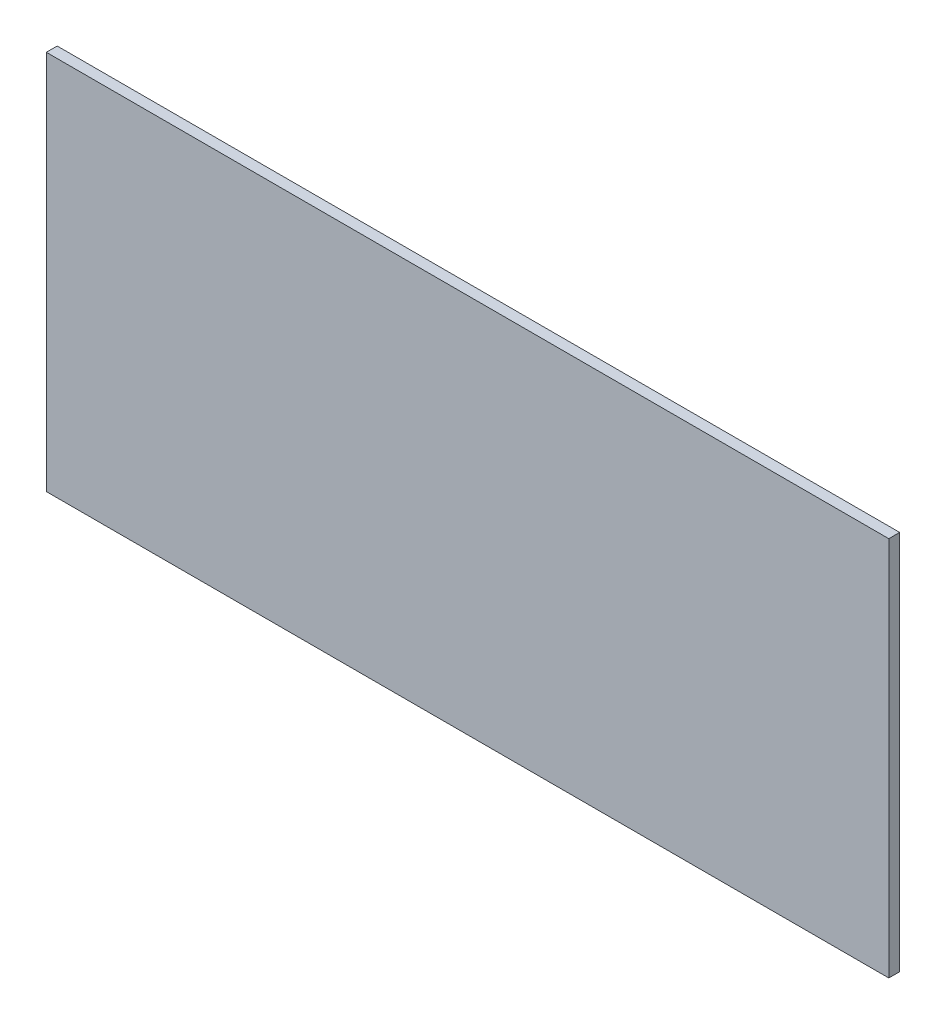
ISO-10303-21;
HEADER;
FILE_DESCRIPTION(('STEP AP214'),'2;1');
FILE_NAME('part.step','',(''),(''),'','','');
FILE_SCHEMA(('AUTOMOTIVE_DESIGN { 1 0 10303 214 1 1 1 1 }'));
ENDSEC;
DATA;
#1=APPLICATION_CONTEXT('core data for automotive mechanical design processes');
#2=APPLICATION_PROTOCOL_DEFINITION('international standard','automotive_design',2000,#1);
#3=PRODUCT_CONTEXT('',#1,'mechanical');
#4=PRODUCT('Part','Part','',(#3));
#5=PRODUCT_RELATED_PRODUCT_CATEGORY('part','',(#4));
#6=PRODUCT_DEFINITION_FORMATION('','',#4);
#7=PRODUCT_DEFINITION_CONTEXT('part definition',#1,'design');
#8=PRODUCT_DEFINITION('design','',#6,#7);
#9=PRODUCT_DEFINITION_SHAPE('','',#8);
#10=(LENGTH_UNIT() NAMED_UNIT(*) SI_UNIT(.MILLI.,.METRE.));
#11=(NAMED_UNIT(*) PLANE_ANGLE_UNIT() SI_UNIT($,.RADIAN.));
#12=(NAMED_UNIT(*) SI_UNIT($,.STERADIAN.) SOLID_ANGLE_UNIT());
#13=UNCERTAINTY_MEASURE_WITH_UNIT(LENGTH_MEASURE(1.E-05),#10,'distance_accuracy_value','');
#14=(GEOMETRIC_REPRESENTATION_CONTEXT(3) GLOBAL_UNCERTAINTY_ASSIGNED_CONTEXT((#13)) GLOBAL_UNIT_ASSIGNED_CONTEXT((#10,
#11,#12)) REPRESENTATION_CONTEXT('',''));
#15=CARTESIAN_POINT('',(0.,0.,0.));
#16=DIRECTION('',(0.,0.,1.));
#17=DIRECTION('',(1.,0.,0.));
#18=AXIS2_PLACEMENT_3D('',#15,#16,#17);
#19=CARTESIAN_POINT('',(77.5,35.,2.));
#20=DIRECTION('',(-1.,0.,0.));
#21=DIRECTION('',(0.,0.,1.));
#22=AXIS2_PLACEMENT_3D('',#19,#20,#21);
#23=PLANE('',#22);
#24=DIRECTION('',(0.,1.,0.));
#25=VECTOR('',#24,1.);
#26=CARTESIAN_POINT('',(77.5,35.,0.));
#27=LINE('',#26,#25);
#28=CARTESIAN_POINT('',(77.5,-35.,0.));
#29=VERTEX_POINT('',#28);
#30=CARTESIAN_POINT('',(77.5,35.,0.));
#31=VERTEX_POINT('',#30);
#32=EDGE_CURVE('E97',#29,#31,#27,.T.);
#33=ORIENTED_EDGE('',*,*,#32,.T.);
#34=DIRECTION('',(0.,0.,-1.));
#35=VECTOR('',#34,1.);
#36=CARTESIAN_POINT('',(77.5,35.,2.));
#37=LINE('',#36,#35);
#38=CARTESIAN_POINT('',(77.5,35.,2.));
#39=VERTEX_POINT('',#38);
#40=EDGE_CURVE('E11',#39,#31,#37,.T.);
#41=ORIENTED_EDGE('',*,*,#40,.F.);
#42=DIRECTION('',(0.,1.,0.));
#43=VECTOR('',#42,1.);
#44=CARTESIAN_POINT('',(77.5,35.,2.));
#45=LINE('',#44,#43);
#46=CARTESIAN_POINT('',(77.5,-35.,2.));
#47=VERTEX_POINT('',#46);
#48=EDGE_CURVE('E85',#47,#39,#45,.T.);
#49=ORIENTED_EDGE('',*,*,#48,.F.);
#50=DIRECTION('',(0.,0.,-1.));
#51=VECTOR('',#50,1.);
#52=CARTESIAN_POINT('',(77.5,-35.,2.));
#53=LINE('',#52,#51);
#54=EDGE_CURVE('E93',#47,#29,#53,.T.);
#55=ORIENTED_EDGE('',*,*,#54,.T.);
#56=EDGE_LOOP('',(#33,#41,#49,#55));
#57=FACE_BOUND('',#56,.T.);
#58=ADVANCED_FACE('F34',(#57),#23,.F.);
#59=CARTESIAN_POINT('',(-77.5,35.,2.));
#60=DIRECTION('',(0.,-1.,0.));
#61=DIRECTION('',(0.,0.,-1.));
#62=AXIS2_PLACEMENT_3D('',#59,#60,#61);
#63=PLANE('',#62);
#64=DIRECTION('',(-1.,0.,0.));
#65=VECTOR('',#64,1.);
#66=CARTESIAN_POINT('',(-77.5,35.,0.));
#67=LINE('',#66,#65);
#68=CARTESIAN_POINT('',(-77.5,35.,0.));
#69=VERTEX_POINT('',#68);
#70=EDGE_CURVE('E89',#31,#69,#67,.T.);
#71=ORIENTED_EDGE('',*,*,#70,.T.);
#72=DIRECTION('',(0.,0.,-1.));
#73=VECTOR('',#72,1.);
#74=CARTESIAN_POINT('',(-77.5,35.,2.));
#75=LINE('',#74,#73);
#76=CARTESIAN_POINT('',(-77.5,35.,2.));
#77=VERTEX_POINT('',#76);
#78=EDGE_CURVE('E42',#77,#69,#75,.T.);
#79=ORIENTED_EDGE('',*,*,#78,.F.);
#80=DIRECTION('',(-1.,0.,0.));
#81=VECTOR('',#80,1.);
#82=CARTESIAN_POINT('',(-77.5,35.,2.));
#83=LINE('',#82,#81);
#84=EDGE_CURVE('E80',#39,#77,#83,.T.);
#85=ORIENTED_EDGE('',*,*,#84,.F.);
#86=ORIENTED_EDGE('',*,*,#40,.T.);
#87=EDGE_LOOP('',(#71,#79,#85,#86));
#88=FACE_BOUND('',#87,.T.);
#89=ADVANCED_FACE('F88',(#88),#63,.F.);
#90=CARTESIAN_POINT('',(-77.5,35.,2.));
#91=DIRECTION('',(1.,0.,0.));
#92=DIRECTION('',(0.,0.,-1.));
#93=AXIS2_PLACEMENT_3D('',#90,#91,#92);
#94=PLANE('',#93);
#95=DIRECTION('',(0.,-1.,0.));
#96=VECTOR('',#95,1.);
#97=CARTESIAN_POINT('',(-77.5,35.,0.));
#98=LINE('',#97,#96);
#99=CARTESIAN_POINT('',(-77.5,-35.,0.));
#100=VERTEX_POINT('',#99);
#101=EDGE_CURVE('E67',#69,#100,#98,.T.);
#102=ORIENTED_EDGE('',*,*,#101,.T.);
#103=DIRECTION('',(0.,0.,-1.));
#104=VECTOR('',#103,1.);
#105=CARTESIAN_POINT('',(-77.5,-35.,2.));
#106=LINE('',#105,#104);
#107=CARTESIAN_POINT('',(-77.5,-35.,2.));
#108=VERTEX_POINT('',#107);
#109=EDGE_CURVE('E90',#108,#100,#106,.T.);
#110=ORIENTED_EDGE('',*,*,#109,.F.);
#111=DIRECTION('',(0.,-1.,0.));
#112=VECTOR('',#111,1.);
#113=CARTESIAN_POINT('',(-77.5,35.,2.));
#114=LINE('',#113,#112);
#115=EDGE_CURVE('E83',#77,#108,#114,.T.);
#116=ORIENTED_EDGE('',*,*,#115,.F.);
#117=ORIENTED_EDGE('',*,*,#78,.T.);
#118=EDGE_LOOP('',(#102,#110,#116,#117));
#119=FACE_BOUND('',#118,.T.);
#120=ADVANCED_FACE('F91',(#119),#94,.F.);
#121=CARTESIAN_POINT('',(-77.5,-35.,2.));
#122=DIRECTION('',(0.,1.,0.));
#123=DIRECTION('',(0.,0.,1.));
#124=AXIS2_PLACEMENT_3D('',#121,#122,#123);
#125=PLANE('',#124);
#126=DIRECTION('',(1.,0.,0.));
#127=VECTOR('',#126,1.);
#128=CARTESIAN_POINT('',(-77.5,-35.,0.));
#129=LINE('',#128,#127);
#130=EDGE_CURVE('E73',#100,#29,#129,.T.);
#131=ORIENTED_EDGE('',*,*,#130,.T.);
#132=ORIENTED_EDGE('',*,*,#54,.F.);
#133=DIRECTION('',(1.,0.,0.));
#134=VECTOR('',#133,1.);
#135=CARTESIAN_POINT('',(-77.5,-35.,2.));
#136=LINE('',#135,#134);
#137=EDGE_CURVE('E50',#108,#47,#136,.T.);
#138=ORIENTED_EDGE('',*,*,#137,.F.);
#139=ORIENTED_EDGE('',*,*,#109,.T.);
#140=EDGE_LOOP('',(#131,#132,#138,#139));
#141=FACE_BOUND('',#140,.T.);
#142=ADVANCED_FACE('F104',(#141),#125,.F.);
#143=CARTESIAN_POINT('',(0.,0.,2.));
#144=DIRECTION('',(0.,0.,1.));
#145=DIRECTION('',(1.,0.,0.));
#146=AXIS2_PLACEMENT_3D('',#143,#144,#145);
#147=PLANE('',#146);
#148=ORIENTED_EDGE('',*,*,#48,.T.);
#149=ORIENTED_EDGE('',*,*,#84,.T.);
#150=ORIENTED_EDGE('',*,*,#115,.T.);
#151=ORIENTED_EDGE('',*,*,#137,.T.);
#152=EDGE_LOOP('',(#148,#149,#150,#151));
#153=FACE_BOUND('',#152,.T.);
#154=ADVANCED_FACE('F81',(#153),#147,.T.);
#155=CARTESIAN_POINT('',(0.,0.,0.));
#156=DIRECTION('',(0.,0.,1.));
#157=DIRECTION('',(1.,0.,0.));
#158=AXIS2_PLACEMENT_3D('',#155,#156,#157);
#159=PLANE('',#158);
#160=ORIENTED_EDGE('',*,*,#32,.F.);
#161=ORIENTED_EDGE('',*,*,#130,.F.);
#162=ORIENTED_EDGE('',*,*,#101,.F.);
#163=ORIENTED_EDGE('',*,*,#70,.F.);
#164=EDGE_LOOP('',(#160,#161,#162,#163));
#165=FACE_BOUND('',#164,.T.);
#166=ADVANCED_FACE('F107',(#165),#159,.F.);
#167=CLOSED_SHELL('',(#58,#89,#120,#142,#154,#166));
#168=MANIFOLD_SOLID_BREP('B2',#167);
#169=ADVANCED_BREP_SHAPE_REPRESENTATION('',(#18,#168),#14);
#170=SHAPE_DEFINITION_REPRESENTATION(#9,#169);
ENDSEC;
END-ISO-10303-21;
